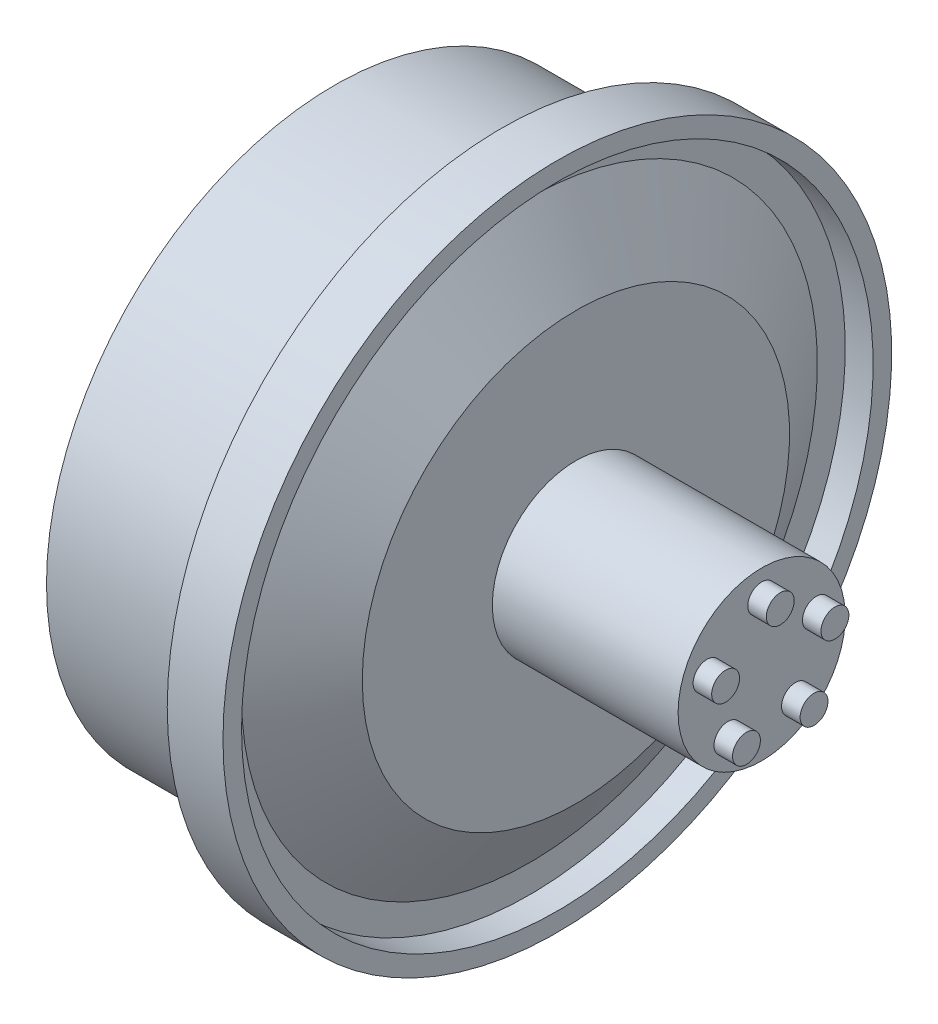
ISO-10303-21;
HEADER;
FILE_DESCRIPTION(('STEP AP214'),'2;1');
FILE_NAME('part.step','',(''),(''),'','','');
FILE_SCHEMA(('AUTOMOTIVE_DESIGN { 1 0 10303 214 1 1 1 1 }'));
ENDSEC;
DATA;
#1=APPLICATION_CONTEXT('core data for automotive mechanical design processes');
#2=APPLICATION_PROTOCOL_DEFINITION('international standard','automotive_design',2000,#1);
#3=PRODUCT_CONTEXT('',#1,'mechanical');
#4=PRODUCT('Part','Part','',(#3));
#5=PRODUCT_RELATED_PRODUCT_CATEGORY('part','',(#4));
#6=PRODUCT_DEFINITION_FORMATION('','',#4);
#7=PRODUCT_DEFINITION_CONTEXT('part definition',#1,'design');
#8=PRODUCT_DEFINITION('design','',#6,#7);
#9=PRODUCT_DEFINITION_SHAPE('','',#8);
#10=(LENGTH_UNIT() NAMED_UNIT(*) SI_UNIT(.MILLI.,.METRE.));
#11=(NAMED_UNIT(*) PLANE_ANGLE_UNIT() SI_UNIT($,.RADIAN.));
#12=(NAMED_UNIT(*) SI_UNIT($,.STERADIAN.) SOLID_ANGLE_UNIT());
#13=UNCERTAINTY_MEASURE_WITH_UNIT(LENGTH_MEASURE(1.E-05),#10,'distance_accuracy_value','');
#14=(GEOMETRIC_REPRESENTATION_CONTEXT(3) GLOBAL_UNCERTAINTY_ASSIGNED_CONTEXT((#13)) GLOBAL_UNIT_ASSIGNED_CONTEXT((#10,
#11,#12)) REPRESENTATION_CONTEXT('',''));
#15=CARTESIAN_POINT('',(0.,0.,0.));
#16=DIRECTION('',(0.,0.,1.));
#17=DIRECTION('',(1.,0.,0.));
#18=AXIS2_PLACEMENT_3D('',#15,#16,#17);
#19=CARTESIAN_POINT('',(-7.62040645692261,0.,0.));
#20=DIRECTION('',(1.,0.,0.));
#21=DIRECTION('',(0.,0.,-1.));
#22=AXIS2_PLACEMENT_3D('',#19,#20,#21);
#23=PLANE('',#22);
#24=CARTESIAN_POINT('',(-7.62040645692261,0.,0.));
#25=DIRECTION('',(-1.,0.,0.));
#26=DIRECTION('',(0.,0.,1.));
#27=AXIS2_PLACEMENT_3D('',#24,#25,#26);
#28=CIRCLE('',#27,15.5);
#29=CARTESIAN_POINT('',(-7.62040645692261,0.,15.5));
#30=VERTEX_POINT('',#29);
#31=EDGE_CURVE('E55',#30,#30,#28,.T.);
#32=ORIENTED_EDGE('',*,*,#31,.T.);
#33=EDGE_LOOP('',(#32));
#34=FACE_BOUND('',#33,.T.);
#35=ADVANCED_FACE('F33',(#34),#23,.F.);
#36=CARTESIAN_POINT('',(-25.,0.,0.));
#37=DIRECTION('',(-1.,0.,0.));
#38=DIRECTION('',(0.,0.,1.));
#39=AXIS2_PLACEMENT_3D('',#36,#37,#38);
#40=CYLINDRICAL_SURFACE('',#39,15.5);
#41=ORIENTED_EDGE('',*,*,#31,.F.);
#42=EDGE_LOOP('',(#41));
#43=FACE_BOUND('',#42,.T.);
#44=CARTESIAN_POINT('',(1.37959354307739,0.,0.));
#45=DIRECTION('',(-1.,0.,0.));
#46=DIRECTION('',(0.,0.,1.));
#47=AXIS2_PLACEMENT_3D('',#44,#45,#46);
#48=CIRCLE('',#47,15.5);
#49=CARTESIAN_POINT('',(1.37959354307739,0.,15.5));
#50=VERTEX_POINT('',#49);
#51=EDGE_CURVE('E58',#50,#50,#48,.T.);
#52=ORIENTED_EDGE('',*,*,#51,.T.);
#53=EDGE_LOOP('',(#52));
#54=FACE_BOUND('',#53,.T.);
#55=ADVANCED_FACE('F116',(#43,#54),#40,.T.);
#56=CARTESIAN_POINT('',(1.37959354307739,0.,-15.5));
#57=DIRECTION('',(1.,0.,0.));
#58=DIRECTION('',(0.,0.,-1.));
#59=AXIS2_PLACEMENT_3D('',#56,#57,#58);
#60=PLANE('',#59);
#61=ORIENTED_EDGE('',*,*,#51,.F.);
#62=EDGE_LOOP('',(#61));
#63=FACE_BOUND('',#62,.T.);
#64=CARTESIAN_POINT('',(1.37959354307739,0.,0.));
#65=DIRECTION('',(-1.,0.,0.));
#66=DIRECTION('',(0.,0.,1.));
#67=AXIS2_PLACEMENT_3D('',#64,#65,#66);
#68=CIRCLE('',#67,18.);
#69=CARTESIAN_POINT('',(1.37959354307739,0.,18.));
#70=VERTEX_POINT('',#69);
#71=EDGE_CURVE('E61',#70,#70,#68,.T.);
#72=ORIENTED_EDGE('',*,*,#71,.T.);
#73=EDGE_LOOP('',(#72));
#74=FACE_BOUND('',#73,.T.);
#75=ADVANCED_FACE('F121',(#63,#74),#60,.F.);
#76=CARTESIAN_POINT('',(-25.,0.,0.));
#77=DIRECTION('',(-1.,0.,0.));
#78=DIRECTION('',(0.,0.,1.));
#79=AXIS2_PLACEMENT_3D('',#76,#77,#78);
#80=CYLINDRICAL_SURFACE('',#79,18.);
#81=ORIENTED_EDGE('',*,*,#71,.F.);
#82=EDGE_LOOP('',(#81));
#83=FACE_BOUND('',#82,.T.);
#84=CARTESIAN_POINT('',(4.37959354307739,0.,0.));
#85=DIRECTION('',(-1.,0.,0.));
#86=DIRECTION('',(0.,0.,1.));
#87=AXIS2_PLACEMENT_3D('',#84,#85,#86);
#88=CIRCLE('',#87,18.);
#89=CARTESIAN_POINT('',(4.37959354307739,0.,18.));
#90=VERTEX_POINT('',#89);
#91=EDGE_CURVE('E64',#90,#90,#88,.T.);
#92=ORIENTED_EDGE('',*,*,#91,.T.);
#93=EDGE_LOOP('',(#92));
#94=FACE_BOUND('',#93,.T.);
#95=ADVANCED_FACE('F129',(#83,#94),#80,.T.);
#96=CARTESIAN_POINT('',(4.37959354307739,0.,-18.));
#97=DIRECTION('',(-1.,0.,0.));
#98=DIRECTION('',(0.,0.,1.));
#99=AXIS2_PLACEMENT_3D('',#96,#97,#98);
#100=PLANE('',#99);
#101=ORIENTED_EDGE('',*,*,#91,.F.);
#102=EDGE_LOOP('',(#101));
#103=FACE_BOUND('',#102,.T.);
#104=CARTESIAN_POINT('',(4.37959354307739,0.,0.));
#105=DIRECTION('',(-1.,0.,0.));
#106=DIRECTION('',(0.,0.,1.));
#107=AXIS2_PLACEMENT_3D('',#104,#105,#106);
#108=CIRCLE('',#107,17.);
#109=CARTESIAN_POINT('',(4.37959354307739,0.,17.));
#110=VERTEX_POINT('',#109);
#111=EDGE_CURVE('E67',#110,#110,#108,.T.);
#112=ORIENTED_EDGE('',*,*,#111,.T.);
#113=EDGE_LOOP('',(#112));
#114=FACE_BOUND('',#113,.T.);
#115=ADVANCED_FACE('F135',(#103,#114),#100,.F.);
#116=CARTESIAN_POINT('',(-25.,0.,0.));
#117=DIRECTION('',(-1.,0.,0.));
#118=DIRECTION('',(0.,0.,1.));
#119=AXIS2_PLACEMENT_3D('',#116,#117,#118);
#120=CYLINDRICAL_SURFACE('',#119,17.);
#121=ORIENTED_EDGE('',*,*,#111,.F.);
#122=EDGE_LOOP('',(#121));
#123=FACE_BOUND('',#122,.T.);
#124=CARTESIAN_POINT('',(2.87959354307739,0.,0.));
#125=DIRECTION('',(-1.,0.,0.));
#126=DIRECTION('',(0.,0.,1.));
#127=AXIS2_PLACEMENT_3D('',#124,#125,#126);
#128=CIRCLE('',#127,17.);
#129=CARTESIAN_POINT('',(2.87959354307739,0.,17.));
#130=VERTEX_POINT('',#129);
#131=EDGE_CURVE('E70',#130,#130,#128,.T.);
#132=ORIENTED_EDGE('',*,*,#131,.T.);
#133=EDGE_LOOP('',(#132));
#134=FACE_BOUND('',#133,.T.);
#135=ADVANCED_FACE('F141',(#123,#134),#120,.F.);
#136=CARTESIAN_POINT('',(2.87959354307739,0.,-17.));
#137=DIRECTION('',(-1.,0.,0.));
#138=DIRECTION('',(0.,0.,1.));
#139=AXIS2_PLACEMENT_3D('',#136,#137,#138);
#140=PLANE('',#139);
#141=ORIENTED_EDGE('',*,*,#131,.F.);
#142=EDGE_LOOP('',(#141));
#143=FACE_BOUND('',#142,.T.);
#144=CARTESIAN_POINT('',(2.87959354307739,0.,0.));
#145=DIRECTION('',(-1.,0.,0.));
#146=DIRECTION('',(0.,0.,1.));
#147=AXIS2_PLACEMENT_3D('',#144,#145,#146);
#148=CIRCLE('',#147,15.5);
#149=CARTESIAN_POINT('',(2.87959354307739,0.,15.5));
#150=VERTEX_POINT('',#149);
#151=EDGE_CURVE('E73',#150,#150,#148,.T.);
#152=ORIENTED_EDGE('',*,*,#151,.T.);
#153=EDGE_LOOP('',(#152));
#154=FACE_BOUND('',#153,.T.);
#155=ADVANCED_FACE('F147',(#143,#154),#140,.F.);
#156=CARTESIAN_POINT('',(5.37959354307739,0.,0.));
#157=DIRECTION('',(-1.,0.,0.));
#158=DIRECTION('',(0.,0.,1.));
#159=AXIS2_PLACEMENT_3D('',#156,#157,#158);
#160=CONICAL_SURFACE('',#159,11.5,1.01219701145133);
#161=ORIENTED_EDGE('',*,*,#151,.F.);
#162=EDGE_LOOP('',(#161));
#163=FACE_BOUND('',#162,.T.);
#164=CARTESIAN_POINT('',(5.37959354307739,0.,0.));
#165=DIRECTION('',(-1.,0.,0.));
#166=DIRECTION('',(0.,0.,1.));
#167=AXIS2_PLACEMENT_3D('',#164,#165,#166);
#168=CIRCLE('',#167,11.5);
#169=CARTESIAN_POINT('',(5.37959354307739,0.,11.5));
#170=VERTEX_POINT('',#169);
#171=EDGE_CURVE('E76',#170,#170,#168,.T.);
#172=ORIENTED_EDGE('',*,*,#171,.T.);
#173=EDGE_LOOP('',(#172));
#174=FACE_BOUND('',#173,.T.);
#175=ADVANCED_FACE('F153',(#163,#174),#160,.T.);
#176=CARTESIAN_POINT('',(5.37959354307739,0.,-11.5));
#177=DIRECTION('',(-1.,0.,0.));
#178=DIRECTION('',(0.,0.,1.));
#179=AXIS2_PLACEMENT_3D('',#176,#177,#178);
#180=PLANE('',#179);
#181=ORIENTED_EDGE('',*,*,#171,.F.);
#182=EDGE_LOOP('',(#181));
#183=FACE_BOUND('',#182,.T.);
#184=CARTESIAN_POINT('',(5.37959354307739,0.,0.));
#185=DIRECTION('',(-1.,0.,0.));
#186=DIRECTION('',(0.,0.,1.));
#187=AXIS2_PLACEMENT_3D('',#184,#185,#186);
#188=CIRCLE('',#187,4.5);
#189=CARTESIAN_POINT('',(5.37959354307739,0.,4.5));
#190=VERTEX_POINT('',#189);
#191=EDGE_CURVE('E79',#190,#190,#188,.T.);
#192=ORIENTED_EDGE('',*,*,#191,.T.);
#193=EDGE_LOOP('',(#192));
#194=FACE_BOUND('',#193,.T.);
#195=ADVANCED_FACE('F159',(#183,#194),#180,.F.);
#196=CARTESIAN_POINT('',(-25.,0.,0.));
#197=DIRECTION('',(-1.,0.,0.));
#198=DIRECTION('',(0.,0.,1.));
#199=AXIS2_PLACEMENT_3D('',#196,#197,#198);
#200=CYLINDRICAL_SURFACE('',#199,4.5);
#201=ORIENTED_EDGE('',*,*,#191,.F.);
#202=EDGE_LOOP('',(#201));
#203=FACE_BOUND('',#202,.T.);
#204=CARTESIAN_POINT('',(15.3795935430774,0.,0.));
#205=DIRECTION('',(-1.,0.,0.));
#206=DIRECTION('',(0.,0.,1.));
#207=AXIS2_PLACEMENT_3D('',#204,#205,#206);
#208=CIRCLE('',#207,4.5);
#209=CARTESIAN_POINT('',(15.3795935430774,0.,4.5));
#210=VERTEX_POINT('',#209);
#211=EDGE_CURVE('E82',#210,#210,#208,.T.);
#212=ORIENTED_EDGE('',*,*,#211,.T.);
#213=EDGE_LOOP('',(#212));
#214=FACE_BOUND('',#213,.T.);
#215=ADVANCED_FACE('F165',(#203,#214),#200,.T.);
#216=CARTESIAN_POINT('',(15.3795935430774,0.,-3.7));
#217=DIRECTION('',(-1.,0.,0.));
#218=DIRECTION('',(0.,0.,1.));
#219=AXIS2_PLACEMENT_3D('',#216,#217,#218);
#220=PLANE('',#219);
#221=CARTESIAN_POINT('',(15.3795935430774,0.956028502200651,2.94235318229355));
#222=DIRECTION('',(-1.,0.,0.));
#223=DIRECTION('',(0.,0.,1.));
#224=AXIS2_PLACEMENT_3D('',#221,#222,#223);
#225=CIRCLE('',#224,0.750000000000158);
#226=CARTESIAN_POINT('',(15.3795935430774,0.956028502200651,3.69235318229371));
#227=VERTEX_POINT('',#226);
#228=EDGE_CURVE('E10',#227,#227,#225,.F.);
#229=ORIENTED_EDGE('',*,*,#228,.F.);
#230=EDGE_LOOP('',(#229));
#231=FACE_BOUND('',#230,.T.);
#232=CARTESIAN_POINT('',(15.3795935430774,-2.50291511297536,1.81847427356365));
#233=DIRECTION('',(-1.,0.,0.));
#234=DIRECTION('',(0.,0.,1.));
#235=AXIS2_PLACEMENT_3D('',#232,#233,#234);
#236=CIRCLE('',#235,0.750000000000276);
#237=CARTESIAN_POINT('',(15.3795935430774,-2.50291511297536,2.56847427356393));
#238=VERTEX_POINT('',#237);
#239=EDGE_CURVE('E39',#238,#238,#236,.F.);
#240=ORIENTED_EDGE('',*,*,#239,.F.);
#241=EDGE_LOOP('',(#240));
#242=FACE_BOUND('',#241,.T.);
#243=CARTESIAN_POINT('',(15.3795935430774,-2.50291511297521,-1.81847427356412));
#244=DIRECTION('',(-1.,0.,0.));
#245=DIRECTION('',(0.,0.,1.));
#246=AXIS2_PLACEMENT_3D('',#243,#244,#245);
#247=CIRCLE('',#246,0.750000000000222);
#248=CARTESIAN_POINT('',(15.3795935430774,-2.50291511297521,-1.0684742735639));
#249=VERTEX_POINT('',#248);
#250=EDGE_CURVE('E43',#249,#249,#247,.F.);
#251=ORIENTED_EDGE('',*,*,#250,.F.);
#252=EDGE_LOOP('',(#251));
#253=FACE_BOUND('',#252,.T.);
#254=CARTESIAN_POINT('',(15.3795935430774,0.956028502200901,-2.94235318229373));
#255=DIRECTION('',(-1.,0.,0.));
#256=DIRECTION('',(0.,0.,1.));
#257=AXIS2_PLACEMENT_3D('',#254,#255,#256);
#258=CIRCLE('',#257,0.750000000000059);
#259=CARTESIAN_POINT('',(15.3795935430774,0.956028502200901,-2.19235318229367));
#260=VERTEX_POINT('',#259);
#261=EDGE_CURVE('E47',#260,#260,#258,.F.);
#262=ORIENTED_EDGE('',*,*,#261,.F.);
#263=EDGE_LOOP('',(#262));
#264=FACE_BOUND('',#263,.T.);
#265=CARTESIAN_POINT('',(15.3795935430774,3.09377322154902,0.));
#266=DIRECTION('',(-1.,0.,0.));
#267=DIRECTION('',(0.,0.,1.));
#268=AXIS2_PLACEMENT_3D('',#265,#266,#267);
#269=CIRCLE('',#268,0.75);
#270=CARTESIAN_POINT('',(15.3795935430774,3.09377322154902,0.75));
#271=VERTEX_POINT('',#270);
#272=EDGE_CURVE('E52',#271,#271,#269,.F.);
#273=ORIENTED_EDGE('',*,*,#272,.F.);
#274=EDGE_LOOP('',(#273));
#275=FACE_BOUND('',#274,.T.);
#276=ORIENTED_EDGE('',*,*,#211,.F.);
#277=EDGE_LOOP('',(#276));
#278=FACE_BOUND('',#277,.T.);
#279=ADVANCED_FACE('F171',(#231,#242,#253,#264,#275,#278),#220,.F.);
#280=CARTESIAN_POINT('',(16.3795935430774,3.09377322154902,0.));
#281=DIRECTION('',(-1.,0.,0.));
#282=DIRECTION('',(0.,0.,1.));
#283=AXIS2_PLACEMENT_3D('',#280,#281,#282);
#284=CYLINDRICAL_SURFACE('',#283,0.75);
#285=CARTESIAN_POINT('',(16.3795935430774,3.09377322154902,0.));
#286=DIRECTION('',(1.,0.,0.));
#287=DIRECTION('',(0.,0.,-1.));
#288=AXIS2_PLACEMENT_3D('',#285,#286,#287);
#289=CIRCLE('',#288,0.75);
#290=CARTESIAN_POINT('',(16.3795935430774,3.09377322154902,-0.75));
#291=VERTEX_POINT('',#290);
#292=EDGE_CURVE('E85',#291,#291,#289,.T.);
#293=ORIENTED_EDGE('',*,*,#292,.F.);
#294=EDGE_LOOP('',(#293));
#295=FACE_BOUND('',#294,.T.);
#296=ORIENTED_EDGE('',*,*,#272,.T.);
#297=EDGE_LOOP('',(#296));
#298=FACE_BOUND('',#297,.T.);
#299=ADVANCED_FACE('F176',(#295,#298),#284,.T.);
#300=CARTESIAN_POINT('',(16.3795935430774,3.09377322154902,0.));
#301=DIRECTION('',(1.,0.,0.));
#302=DIRECTION('',(0.,0.,-1.));
#303=AXIS2_PLACEMENT_3D('',#300,#301,#302);
#304=PLANE('',#303);
#305=ORIENTED_EDGE('',*,*,#292,.T.);
#306=EDGE_LOOP('',(#305));
#307=FACE_BOUND('',#306,.T.);
#308=ADVANCED_FACE('F182',(#307),#304,.T.);
#309=CARTESIAN_POINT('',(16.3795935430774,0.956028502200901,-2.94235318229373));
#310=DIRECTION('',(-1.,0.,0.));
#311=DIRECTION('',(0.,0.,1.));
#312=AXIS2_PLACEMENT_3D('',#309,#310,#311);
#313=CYLINDRICAL_SURFACE('',#312,0.750000000000059);
#314=CARTESIAN_POINT('',(16.3795935430774,0.956028502200901,-2.94235318229373));
#315=DIRECTION('',(1.,0.,0.));
#316=DIRECTION('',(0.,0.,-1.));
#317=AXIS2_PLACEMENT_3D('',#314,#315,#316);
#318=CIRCLE('',#317,0.750000000000059);
#319=CARTESIAN_POINT('',(16.3795935430774,0.956028502200901,-3.69235318229379));
#320=VERTEX_POINT('',#319);
#321=EDGE_CURVE('E88',#320,#320,#318,.T.);
#322=ORIENTED_EDGE('',*,*,#321,.F.);
#323=EDGE_LOOP('',(#322));
#324=FACE_BOUND('',#323,.T.);
#325=ORIENTED_EDGE('',*,*,#261,.T.);
#326=EDGE_LOOP('',(#325));
#327=FACE_BOUND('',#326,.T.);
#328=ADVANCED_FACE('F189',(#324,#327),#313,.T.);
#329=CARTESIAN_POINT('',(16.3795935430774,0.956028502200901,-2.94235318229373));
#330=DIRECTION('',(1.,0.,0.));
#331=DIRECTION('',(0.,0.,-1.));
#332=AXIS2_PLACEMENT_3D('',#329,#330,#331);
#333=PLANE('',#332);
#334=ORIENTED_EDGE('',*,*,#321,.T.);
#335=EDGE_LOOP('',(#334));
#336=FACE_BOUND('',#335,.T.);
#337=ADVANCED_FACE('F193',(#336),#333,.T.);
#338=CARTESIAN_POINT('',(16.3795935430774,-2.50291511297521,-1.81847427356412));
#339=DIRECTION('',(-1.,0.,0.));
#340=DIRECTION('',(0.,0.,1.));
#341=AXIS2_PLACEMENT_3D('',#338,#339,#340);
#342=CYLINDRICAL_SURFACE('',#341,0.750000000000222);
#343=CARTESIAN_POINT('',(16.3795935430774,-2.50291511297521,-1.81847427356412));
#344=DIRECTION('',(1.,0.,0.));
#345=DIRECTION('',(0.,0.,-1.));
#346=AXIS2_PLACEMENT_3D('',#343,#344,#345);
#347=CIRCLE('',#346,0.750000000000222);
#348=CARTESIAN_POINT('',(16.3795935430774,-2.50291511297521,-2.56847427356435));
#349=VERTEX_POINT('',#348);
#350=EDGE_CURVE('E91',#349,#349,#347,.T.);
#351=ORIENTED_EDGE('',*,*,#350,.F.);
#352=EDGE_LOOP('',(#351));
#353=FACE_BOUND('',#352,.T.);
#354=ORIENTED_EDGE('',*,*,#250,.T.);
#355=EDGE_LOOP('',(#354));
#356=FACE_BOUND('',#355,.T.);
#357=ADVANCED_FACE('F197',(#353,#356),#342,.T.);
#358=CARTESIAN_POINT('',(16.3795935430774,-2.50291511297521,-1.81847427356412));
#359=DIRECTION('',(1.,0.,0.));
#360=DIRECTION('',(0.,0.,-1.));
#361=AXIS2_PLACEMENT_3D('',#358,#359,#360);
#362=PLANE('',#361);
#363=ORIENTED_EDGE('',*,*,#350,.T.);
#364=EDGE_LOOP('',(#363));
#365=FACE_BOUND('',#364,.T.);
#366=ADVANCED_FACE('F201',(#365),#362,.T.);
#367=CARTESIAN_POINT('',(16.3795935430774,-2.50291511297536,1.81847427356365));
#368=DIRECTION('',(-1.,0.,0.));
#369=DIRECTION('',(0.,0.,1.));
#370=AXIS2_PLACEMENT_3D('',#367,#368,#369);
#371=CYLINDRICAL_SURFACE('',#370,0.750000000000276);
#372=CARTESIAN_POINT('',(16.3795935430774,-2.50291511297536,1.81847427356365));
#373=DIRECTION('',(1.,0.,0.));
#374=DIRECTION('',(0.,0.,-1.));
#375=AXIS2_PLACEMENT_3D('',#372,#373,#374);
#376=CIRCLE('',#375,0.750000000000276);
#377=CARTESIAN_POINT('',(16.3795935430774,-2.50291511297536,1.06847427356337));
#378=VERTEX_POINT('',#377);
#379=EDGE_CURVE('E94',#378,#378,#376,.T.);
#380=ORIENTED_EDGE('',*,*,#379,.F.);
#381=EDGE_LOOP('',(#380));
#382=FACE_BOUND('',#381,.T.);
#383=ORIENTED_EDGE('',*,*,#239,.T.);
#384=EDGE_LOOP('',(#383));
#385=FACE_BOUND('',#384,.T.);
#386=ADVANCED_FACE('F112',(#382,#385),#371,.T.);
#387=CARTESIAN_POINT('',(16.3795935430774,-2.50291511297536,1.81847427356365));
#388=DIRECTION('',(1.,0.,0.));
#389=DIRECTION('',(0.,0.,-1.));
#390=AXIS2_PLACEMENT_3D('',#387,#388,#389);
#391=PLANE('',#390);
#392=ORIENTED_EDGE('',*,*,#379,.T.);
#393=EDGE_LOOP('',(#392));
#394=FACE_BOUND('',#393,.T.);
#395=ADVANCED_FACE('F105',(#394),#391,.T.);
#396=CARTESIAN_POINT('',(16.3795935430774,0.956028502200651,2.94235318229355));
#397=DIRECTION('',(-1.,0.,0.));
#398=DIRECTION('',(0.,0.,1.));
#399=AXIS2_PLACEMENT_3D('',#396,#397,#398);
#400=CYLINDRICAL_SURFACE('',#399,0.750000000000158);
#401=CARTESIAN_POINT('',(16.3795935430774,0.956028502200651,2.94235318229355));
#402=DIRECTION('',(1.,0.,0.));
#403=DIRECTION('',(0.,0.,-1.));
#404=AXIS2_PLACEMENT_3D('',#401,#402,#403);
#405=CIRCLE('',#404,0.750000000000158);
#406=CARTESIAN_POINT('',(16.3795935430774,0.956028502200651,2.1923531822934));
#407=VERTEX_POINT('',#406);
#408=EDGE_CURVE('E97',#407,#407,#405,.T.);
#409=ORIENTED_EDGE('',*,*,#408,.F.);
#410=EDGE_LOOP('',(#409));
#411=FACE_BOUND('',#410,.T.);
#412=ORIENTED_EDGE('',*,*,#228,.T.);
#413=EDGE_LOOP('',(#412));
#414=FACE_BOUND('',#413,.T.);
#415=ADVANCED_FACE('F103',(#411,#414),#400,.T.);
#416=CARTESIAN_POINT('',(16.3795935430774,0.956028502200651,2.94235318229355));
#417=DIRECTION('',(1.,0.,0.));
#418=DIRECTION('',(0.,0.,-1.));
#419=AXIS2_PLACEMENT_3D('',#416,#417,#418);
#420=PLANE('',#419);
#421=ORIENTED_EDGE('',*,*,#408,.T.);
#422=EDGE_LOOP('',(#421));
#423=FACE_BOUND('',#422,.T.);
#424=ADVANCED_FACE('F101',(#423),#420,.T.);
#425=CLOSED_SHELL('',(#35,#55,#75,#95,#115,#135,#155,#175,#195,#215,#279,#299,#308,#328,#337,
#357,#366,#386,#395,#415,#424));
#426=MANIFOLD_SOLID_BREP('B2',#425);
#427=ADVANCED_BREP_SHAPE_REPRESENTATION('',(#18,#426),#14);
#428=SHAPE_DEFINITION_REPRESENTATION(#9,#427);
ENDSEC;
END-ISO-10303-21;
